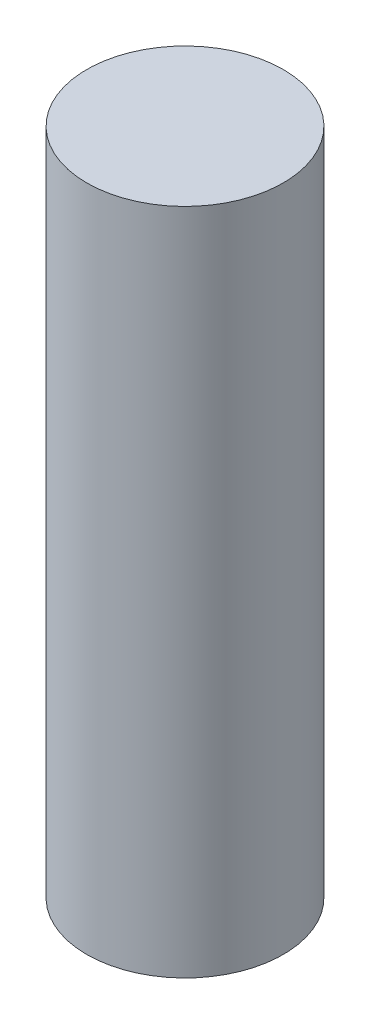
ISO-10303-21;
HEADER;
FILE_DESCRIPTION(('STEP AP214'),'2;1');
FILE_NAME('part.step','',(''),(''),'','','');
FILE_SCHEMA(('AUTOMOTIVE_DESIGN { 1 0 10303 214 1 1 1 1 }'));
ENDSEC;
DATA;
#1=APPLICATION_CONTEXT('core data for automotive mechanical design processes');
#2=APPLICATION_PROTOCOL_DEFINITION('international standard','automotive_design',2000,#1);
#3=PRODUCT_CONTEXT('',#1,'mechanical');
#4=PRODUCT('Part','Part','',(#3));
#5=PRODUCT_RELATED_PRODUCT_CATEGORY('part','',(#4));
#6=PRODUCT_DEFINITION_FORMATION('','',#4);
#7=PRODUCT_DEFINITION_CONTEXT('part definition',#1,'design');
#8=PRODUCT_DEFINITION('design','',#6,#7);
#9=PRODUCT_DEFINITION_SHAPE('','',#8);
#10=(LENGTH_UNIT() NAMED_UNIT(*) SI_UNIT(.MILLI.,.METRE.));
#11=(NAMED_UNIT(*) PLANE_ANGLE_UNIT() SI_UNIT($,.RADIAN.));
#12=(NAMED_UNIT(*) SI_UNIT($,.STERADIAN.) SOLID_ANGLE_UNIT());
#13=UNCERTAINTY_MEASURE_WITH_UNIT(LENGTH_MEASURE(1.E-05),#10,'distance_accuracy_value','');
#14=(GEOMETRIC_REPRESENTATION_CONTEXT(3) GLOBAL_UNCERTAINTY_ASSIGNED_CONTEXT((#13)) GLOBAL_UNIT_ASSIGNED_CONTEXT((#10,
#11,#12)) REPRESENTATION_CONTEXT('',''));
#15=CARTESIAN_POINT('',(0.,0.,0.));
#16=DIRECTION('',(0.,0.,1.));
#17=DIRECTION('',(1.,0.,0.));
#18=AXIS2_PLACEMENT_3D('',#15,#16,#17);
#19=CARTESIAN_POINT('',(0.,85.,0.));
#20=DIRECTION('',(0.,-1.,0.));
#21=DIRECTION('',(0.,0.,-1.));
#22=AXIS2_PLACEMENT_3D('',#19,#20,#21);
#23=CYLINDRICAL_SURFACE('',#22,12.5);
#24=CARTESIAN_POINT('',(0.,85.,0.));
#25=DIRECTION('',(0.,1.,0.));
#26=DIRECTION('',(0.,0.,1.));
#27=AXIS2_PLACEMENT_3D('',#24,#25,#26);
#28=CIRCLE('',#27,12.5);
#29=CARTESIAN_POINT('',(0.,85.,12.5));
#30=VERTEX_POINT('',#29);
#31=EDGE_CURVE('E10',#30,#30,#28,.T.);
#32=ORIENTED_EDGE('',*,*,#31,.F.);
#33=EDGE_LOOP('',(#32));
#34=FACE_BOUND('',#33,.T.);
#35=CARTESIAN_POINT('',(0.,0.,0.));
#36=DIRECTION('',(0.,1.,0.));
#37=DIRECTION('',(0.,0.,1.));
#38=AXIS2_PLACEMENT_3D('',#35,#36,#37);
#39=CIRCLE('',#38,12.5);
#40=CARTESIAN_POINT('',(0.,0.,12.5));
#41=VERTEX_POINT('',#40);
#42=EDGE_CURVE('E40',#41,#41,#39,.T.);
#43=ORIENTED_EDGE('',*,*,#42,.T.);
#44=EDGE_LOOP('',(#43));
#45=FACE_BOUND('',#44,.T.);
#46=ADVANCED_FACE('F37',(#34,#45),#23,.T.);
#47=CARTESIAN_POINT('',(0.,85.,0.));
#48=DIRECTION('',(0.,1.,0.));
#49=DIRECTION('',(0.,0.,1.));
#50=AXIS2_PLACEMENT_3D('',#47,#48,#49);
#51=PLANE('',#50);
#52=ORIENTED_EDGE('',*,*,#31,.T.);
#53=EDGE_LOOP('',(#52));
#54=FACE_BOUND('',#53,.T.);
#55=ADVANCED_FACE('F54',(#54),#51,.T.);
#56=CARTESIAN_POINT('',(0.,0.,0.));
#57=DIRECTION('',(0.,1.,0.));
#58=DIRECTION('',(0.,0.,1.));
#59=AXIS2_PLACEMENT_3D('',#56,#57,#58);
#60=PLANE('',#59);
#61=ORIENTED_EDGE('',*,*,#42,.F.);
#62=EDGE_LOOP('',(#61));
#63=FACE_BOUND('',#62,.T.);
#64=ADVANCED_FACE('F52',(#63),#60,.F.);
#65=CLOSED_SHELL('',(#46,#55,#64));
#66=MANIFOLD_SOLID_BREP('B2',#65);
#67=ADVANCED_BREP_SHAPE_REPRESENTATION('',(#18,#66),#14);
#68=SHAPE_DEFINITION_REPRESENTATION(#9,#67);
ENDSEC;
END-ISO-10303-21;
